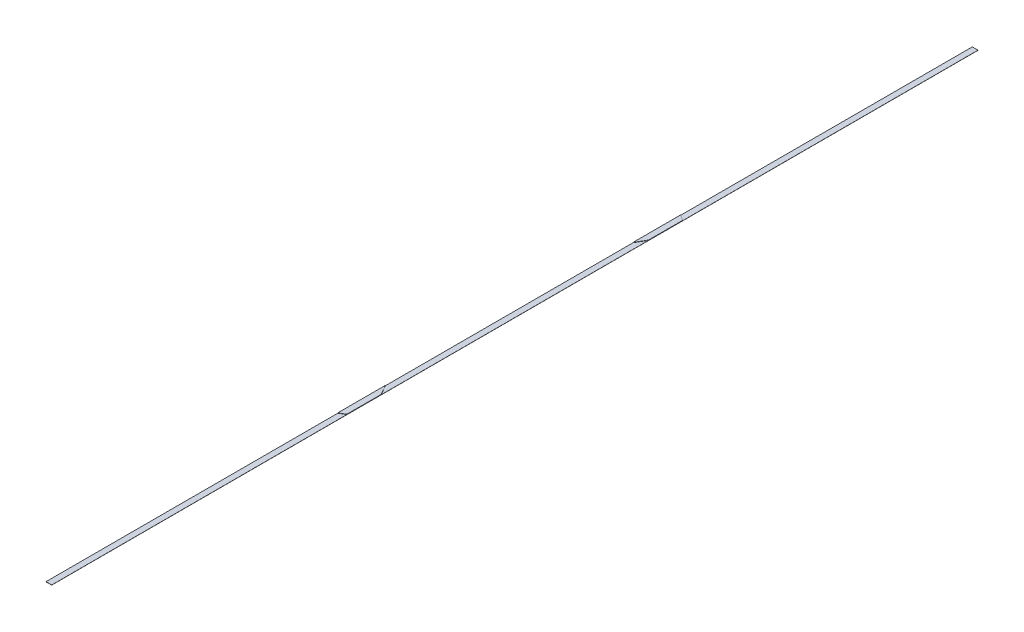
ISO-10303-21;
HEADER;
FILE_DESCRIPTION(('STEP AP214'),'2;1');
FILE_NAME('part.step','',(''),(''),'','','');
FILE_SCHEMA(('AUTOMOTIVE_DESIGN { 1 0 10303 214 1 1 1 1 }'));
ENDSEC;
DATA;
#1=APPLICATION_CONTEXT('core data for automotive mechanical design processes');
#2=APPLICATION_PROTOCOL_DEFINITION('international standard','automotive_design',2000,#1);
#3=PRODUCT_CONTEXT('',#1,'mechanical');
#4=PRODUCT('Part','Part','',(#3));
#5=PRODUCT_RELATED_PRODUCT_CATEGORY('part','',(#4));
#6=PRODUCT_DEFINITION_FORMATION('','',#4);
#7=PRODUCT_DEFINITION_CONTEXT('part definition',#1,'design');
#8=PRODUCT_DEFINITION('design','',#6,#7);
#9=PRODUCT_DEFINITION_SHAPE('','',#8);
#10=(LENGTH_UNIT() NAMED_UNIT(*) SI_UNIT(.MILLI.,.METRE.));
#11=(NAMED_UNIT(*) PLANE_ANGLE_UNIT() SI_UNIT($,.RADIAN.));
#12=(NAMED_UNIT(*) SI_UNIT($,.STERADIAN.) SOLID_ANGLE_UNIT());
#13=UNCERTAINTY_MEASURE_WITH_UNIT(LENGTH_MEASURE(1.E-05),#10,'distance_accuracy_value','');
#14=(GEOMETRIC_REPRESENTATION_CONTEXT(3) GLOBAL_UNCERTAINTY_ASSIGNED_CONTEXT((#13)) GLOBAL_UNIT_ASSIGNED_CONTEXT((#10,
#11,#12)) REPRESENTATION_CONTEXT('',''));
#15=CARTESIAN_POINT('',(0.,0.,0.));
#16=DIRECTION('',(0.,0.,1.));
#17=DIRECTION('',(1.,0.,0.));
#18=AXIS2_PLACEMENT_3D('',#15,#16,#17);
#19=CARTESIAN_POINT('',(0.,1.27,0.));
#20=DIRECTION('',(0.,1.,0.));
#21=DIRECTION('',(0.,0.,1.));
#22=AXIS2_PLACEMENT_3D('',#19,#20,#21);
#23=PLANE('',#22);
#24=DIRECTION('',(0.866025403784439,0.,0.499999999999998));
#25=VECTOR('',#24,1.);
#26=CARTESIAN_POINT('',(-25.3999999999997,1.27,-1521.16536));
#27=LINE('',#26,#25);
#28=CARTESIAN_POINT('',(-25.4000000000002,1.27,-1521.16536));
#29=VERTEX_POINT('',#28);
#30=CARTESIAN_POINT('',(25.4,1.27,-1491.83596632517));
#31=VERTEX_POINT('',#30);
#32=EDGE_CURVE('E140',#29,#31,#27,.T.);
#33=ORIENTED_EDGE('',*,*,#32,.T.);
#34=DIRECTION('',(0.,0.,-1.));
#35=VECTOR('',#34,1.);
#36=CARTESIAN_POINT('',(25.3999999999995,1.27,-4111.96536));
#37=LINE('',#36,#35);
#38=CARTESIAN_POINT('',(25.3999999999995,1.27,-4111.96536));
#39=VERTEX_POINT('',#38);
#40=EDGE_CURVE('E128',#31,#39,#37,.T.);
#41=ORIENTED_EDGE('',*,*,#40,.T.);
#42=DIRECTION('',(-1.,0.,0.));
#43=VECTOR('',#42,1.);
#44=CARTESIAN_POINT('',(-25.4000000000005,1.27,-4111.96536));
#45=LINE('',#44,#43);
#46=CARTESIAN_POINT('',(-25.4000000000005,1.27,-4111.96536));
#47=VERTEX_POINT('',#46);
#48=EDGE_CURVE('E193',#39,#47,#45,.T.);
#49=ORIENTED_EDGE('',*,*,#48,.T.);
#50=DIRECTION('',(0.,0.,1.));
#51=VECTOR('',#50,1.);
#52=CARTESIAN_POINT('',(-25.4000000000005,1.27,-4111.96536));
#53=LINE('',#52,#51);
#54=EDGE_CURVE('E61',#47,#29,#53,.T.);
#55=ORIENTED_EDGE('',*,*,#54,.T.);
#56=EDGE_LOOP('',(#33,#41,#49,#55));
#57=FACE_BOUND('',#56,.T.);
#58=ADVANCED_FACE('F38',(#57),#23,.T.);
#59=DIRECTION('',(0.86602540378444,0.,-0.499999999999998));
#60=VECTOR('',#59,1.);
#61=CARTESIAN_POINT('',(652.333922558449,1.27,1129.87549737194));
#62=LINE('',#61,#60);
#63=CARTESIAN_POINT('',(-25.3999999999995,1.27,1521.16536));
#64=VERTEX_POINT('',#63);
#65=CARTESIAN_POINT('',(25.4000000000004,1.27,1491.83596632517));
#66=VERTEX_POINT('',#65);
#67=EDGE_CURVE('E170',#64,#66,#62,.T.);
#68=ORIENTED_EDGE('',*,*,#67,.F.);
#69=CARTESIAN_POINT('',(-25.3999999999995,1.27,4111.96536));
#70=VERTEX_POINT('',#69);
#71=EDGE_CURVE('E195',#64,#70,#53,.T.);
#72=ORIENTED_EDGE('',*,*,#71,.T.);
#73=DIRECTION('',(1.,0.,0.));
#74=VECTOR('',#73,1.);
#75=CARTESIAN_POINT('',(-25.3999999999995,1.27,4111.96536));
#76=LINE('',#75,#74);
#77=CARTESIAN_POINT('',(25.4000000000005,1.27,4111.96536));
#78=VERTEX_POINT('',#77);
#79=EDGE_CURVE('E197',#70,#78,#76,.T.);
#80=ORIENTED_EDGE('',*,*,#79,.T.);
#81=EDGE_CURVE('E138',#78,#66,#37,.T.);
#82=ORIENTED_EDGE('',*,*,#81,.T.);
#83=EDGE_LOOP('',(#68,#72,#80,#82));
#84=FACE_BOUND('',#83,.T.);
#85=ADVANCED_FACE('F230',(#84),#23,.T.);
#86=CARTESIAN_POINT('',(25.3999999999995,1.27,-4111.96536));
#87=DIRECTION('',(-1.,0.,0.));
#88=DIRECTION('',(0.,0.,1.));
#89=AXIS2_PLACEMENT_3D('',#86,#87,#88);
#90=PLANE('',#89);
#91=DIRECTION('',(0.,0.,-1.));
#92=VECTOR('',#91,1.);
#93=CARTESIAN_POINT('',(25.3999999999995,0.,-4111.96536));
#94=LINE('',#93,#92);
#95=CARTESIAN_POINT('',(25.4000000000005,0.,4111.96536));
#96=VERTEX_POINT('',#95);
#97=CARTESIAN_POINT('',(25.3999999999995,0.,-4111.96536));
#98=VERTEX_POINT('',#97);
#99=EDGE_CURVE('E191',#96,#98,#94,.T.);
#100=ORIENTED_EDGE('',*,*,#99,.T.);
#101=DIRECTION('',(0.,-1.,0.));
#102=VECTOR('',#101,1.);
#103=CARTESIAN_POINT('',(25.3999999999995,1.27,-4111.96536));
#104=LINE('',#103,#102);
#105=EDGE_CURVE('E11',#39,#98,#104,.T.);
#106=ORIENTED_EDGE('',*,*,#105,.F.);
#107=ORIENTED_EDGE('',*,*,#40,.F.);
#108=DIRECTION('',(0.,-1.,0.));
#109=VECTOR('',#108,1.);
#110=CARTESIAN_POINT('',(25.4,3.92684,-1491.83596632517));
#111=LINE('',#110,#109);
#112=CARTESIAN_POINT('',(25.4,3.92684,-1491.83596632517));
#113=VERTEX_POINT('',#112);
#114=EDGE_CURVE('E132',#113,#31,#111,.T.);
#115=ORIENTED_EDGE('',*,*,#114,.F.);
#116=DIRECTION('',(0.,0.,-1.));
#117=VECTOR('',#116,1.);
#118=CARTESIAN_POINT('',(25.4,3.92684,-1187.03596632517));
#119=LINE('',#118,#117);
#120=CARTESIAN_POINT('',(25.4,3.92684,-1187.03596632517));
#121=VERTEX_POINT('',#120);
#122=EDGE_CURVE('E163',#121,#113,#119,.T.);
#123=ORIENTED_EDGE('',*,*,#122,.F.);
#124=DIRECTION('',(0.,-1.,0.));
#125=VECTOR('',#124,1.);
#126=CARTESIAN_POINT('',(25.4,3.92684,-1187.03596632517));
#127=LINE('',#126,#125);
#128=CARTESIAN_POINT('',(25.3999999999999,1.27,-1187.03596632517));
#129=VERTEX_POINT('',#128);
#130=EDGE_CURVE('E148',#121,#129,#127,.T.);
#131=ORIENTED_EDGE('',*,*,#130,.T.);
#132=CARTESIAN_POINT('',(25.4000000000006,1.27,1187.03596632517));
#133=VERTEX_POINT('',#132);
#134=EDGE_CURVE('E135',#133,#129,#37,.T.);
#135=ORIENTED_EDGE('',*,*,#134,.F.);
#136=DIRECTION('',(0.,-1.,0.));
#137=VECTOR('',#136,1.);
#138=CARTESIAN_POINT('',(25.4000000000002,3.92684,1187.03596632517));
#139=LINE('',#138,#137);
#140=CARTESIAN_POINT('',(25.4000000000002,3.92684,1187.03596632517));
#141=VERTEX_POINT('',#140);
#142=EDGE_CURVE('E189',#141,#133,#139,.T.);
#143=ORIENTED_EDGE('',*,*,#142,.F.);
#144=DIRECTION('',(0.,0.,-1.));
#145=VECTOR('',#144,1.);
#146=CARTESIAN_POINT('',(25.4,3.92684,0.));
#147=LINE('',#146,#145);
#148=CARTESIAN_POINT('',(25.4000000000003,3.92684,1491.83596632517));
#149=VERTEX_POINT('',#148);
#150=EDGE_CURVE('E166',#149,#141,#147,.T.);
#151=ORIENTED_EDGE('',*,*,#150,.F.);
#152=DIRECTION('',(0.,-1.,0.));
#153=VECTOR('',#152,1.);
#154=CARTESIAN_POINT('',(25.4000000000003,3.92684,1491.83596632517));
#155=LINE('',#154,#153);
#156=EDGE_CURVE('E176',#149,#66,#155,.T.);
#157=ORIENTED_EDGE('',*,*,#156,.T.);
#158=ORIENTED_EDGE('',*,*,#81,.F.);
#159=DIRECTION('',(0.,-1.,0.));
#160=VECTOR('',#159,1.);
#161=CARTESIAN_POINT('',(25.4000000000005,1.27,4111.96536));
#162=LINE('',#161,#160);
#163=EDGE_CURVE('E200',#78,#96,#162,.T.);
#164=ORIENTED_EDGE('',*,*,#163,.T.);
#165=EDGE_LOOP('',(#100,#106,#107,#115,#123,#131,#135,#143,#151,#157,#158,#164));
#166=FACE_BOUND('',#165,.T.);
#167=ADVANCED_FACE('F40',(#166),#90,.F.);
#168=CARTESIAN_POINT('',(-25.4000000000005,1.27,-4111.96536));
#169=DIRECTION('',(0.,0.,1.));
#170=DIRECTION('',(1.,0.,0.));
#171=AXIS2_PLACEMENT_3D('',#168,#169,#170);
#172=PLANE('',#171);
#173=DIRECTION('',(-1.,0.,0.));
#174=VECTOR('',#173,1.);
#175=CARTESIAN_POINT('',(-25.4000000000005,0.,-4111.96536));
#176=LINE('',#175,#174);
#177=CARTESIAN_POINT('',(-25.4000000000005,0.,-4111.96536));
#178=VERTEX_POINT('',#177);
#179=EDGE_CURVE('E202',#98,#178,#176,.T.);
#180=ORIENTED_EDGE('',*,*,#179,.T.);
#181=DIRECTION('',(0.,-1.,0.));
#182=VECTOR('',#181,1.);
#183=CARTESIAN_POINT('',(-25.4000000000005,1.27,-4111.96536));
#184=LINE('',#183,#182);
#185=EDGE_CURVE('E46',#47,#178,#184,.T.);
#186=ORIENTED_EDGE('',*,*,#185,.F.);
#187=ORIENTED_EDGE('',*,*,#48,.F.);
#188=ORIENTED_EDGE('',*,*,#105,.T.);
#189=EDGE_LOOP('',(#180,#186,#187,#188));
#190=FACE_BOUND('',#189,.T.);
#191=ADVANCED_FACE('F273',(#190),#172,.F.);
#192=CARTESIAN_POINT('',(-25.4000000000005,1.27,-4111.96536));
#193=DIRECTION('',(1.,0.,0.));
#194=DIRECTION('',(0.,0.,-1.));
#195=AXIS2_PLACEMENT_3D('',#192,#193,#194);
#196=PLANE('',#195);
#197=DIRECTION('',(0.,0.,1.));
#198=VECTOR('',#197,1.);
#199=CARTESIAN_POINT('',(-25.4000000000005,0.,-4111.96536));
#200=LINE('',#199,#198);
#201=CARTESIAN_POINT('',(-25.3999999999995,0.,4111.96536));
#202=VERTEX_POINT('',#201);
#203=EDGE_CURVE('E204',#178,#202,#200,.T.);
#204=ORIENTED_EDGE('',*,*,#203,.T.);
#205=DIRECTION('',(0.,-1.,0.));
#206=VECTOR('',#205,1.);
#207=CARTESIAN_POINT('',(-25.3999999999995,1.27,4111.96536));
#208=LINE('',#207,#206);
#209=EDGE_CURVE('E209',#70,#202,#208,.T.);
#210=ORIENTED_EDGE('',*,*,#209,.F.);
#211=ORIENTED_EDGE('',*,*,#71,.F.);
#212=DIRECTION('',(0.,-1.,0.));
#213=VECTOR('',#212,1.);
#214=CARTESIAN_POINT('',(-25.3999999999997,3.92684,1521.16536));
#215=LINE('',#214,#213);
#216=CARTESIAN_POINT('',(-25.3999999999997,3.92684,1521.16536));
#217=VERTEX_POINT('',#216);
#218=EDGE_CURVE('E183',#217,#64,#215,.T.);
#219=ORIENTED_EDGE('',*,*,#218,.F.);
#220=DIRECTION('',(0.,0.,1.));
#221=VECTOR('',#220,1.);
#222=CARTESIAN_POINT('',(-25.4,3.92684,0.));
#223=LINE('',#222,#221);
#224=CARTESIAN_POINT('',(-25.3999999999999,3.92684,1099.04778530067));
#225=VERTEX_POINT('',#224);
#226=EDGE_CURVE('E172',#225,#217,#223,.T.);
#227=ORIENTED_EDGE('',*,*,#226,.F.);
#228=DIRECTION('',(0.,-1.,0.));
#229=VECTOR('',#228,1.);
#230=CARTESIAN_POINT('',(-25.3999999999999,3.92684,1099.04778530067));
#231=LINE('',#230,#229);
#232=CARTESIAN_POINT('',(-25.3999999999999,1.27,1099.04778530067));
#233=VERTEX_POINT('',#232);
#234=EDGE_CURVE('E186',#225,#233,#231,.T.);
#235=ORIENTED_EDGE('',*,*,#234,.T.);
#236=CARTESIAN_POINT('',(-25.3999999999999,1.27,-1099.04778530067));
#237=VERTEX_POINT('',#236);
#238=EDGE_CURVE('E198',#237,#233,#53,.T.);
#239=ORIENTED_EDGE('',*,*,#238,.F.);
#240=DIRECTION('',(0.,-1.,0.));
#241=VECTOR('',#240,1.);
#242=CARTESIAN_POINT('',(-25.3999999999998,3.92684,-1099.04778530067));
#243=LINE('',#242,#241);
#244=CARTESIAN_POINT('',(-25.3999999999998,3.92684,-1099.04778530067));
#245=VERTEX_POINT('',#244);
#246=EDGE_CURVE('E153',#245,#237,#243,.T.);
#247=ORIENTED_EDGE('',*,*,#246,.F.);
#248=DIRECTION('',(0.,0.,1.));
#249=VECTOR('',#248,1.);
#250=CARTESIAN_POINT('',(-25.3999999999997,3.92684,-1521.16536));
#251=LINE('',#250,#249);
#252=CARTESIAN_POINT('',(-25.3999999999997,3.92684,-1521.16536));
#253=VERTEX_POINT('',#252);
#254=EDGE_CURVE('E147',#253,#245,#251,.T.);
#255=ORIENTED_EDGE('',*,*,#254,.F.);
#256=DIRECTION('',(0.,-1.,0.));
#257=VECTOR('',#256,1.);
#258=CARTESIAN_POINT('',(-25.3999999999997,3.92684,-1521.16536));
#259=LINE('',#258,#257);
#260=EDGE_CURVE('E158',#253,#29,#259,.T.);
#261=ORIENTED_EDGE('',*,*,#260,.T.);
#262=ORIENTED_EDGE('',*,*,#54,.F.);
#263=ORIENTED_EDGE('',*,*,#185,.T.);
#264=EDGE_LOOP('',(#204,#210,#211,#219,#227,#235,#239,#247,#255,#261,#262,#263));
#265=FACE_BOUND('',#264,.T.);
#266=ADVANCED_FACE('F215',(#265),#196,.F.);
#267=CARTESIAN_POINT('',(-25.3999999999995,1.27,4111.96536));
#268=DIRECTION('',(0.,0.,-1.));
#269=DIRECTION('',(-1.,0.,0.));
#270=AXIS2_PLACEMENT_3D('',#267,#268,#269);
#271=PLANE('',#270);
#272=DIRECTION('',(1.,0.,0.));
#273=VECTOR('',#272,1.);
#274=CARTESIAN_POINT('',(-25.3999999999995,0.,4111.96536));
#275=LINE('',#274,#273);
#276=EDGE_CURVE('E136',#202,#96,#275,.T.);
#277=ORIENTED_EDGE('',*,*,#276,.T.);
#278=ORIENTED_EDGE('',*,*,#163,.F.);
#279=ORIENTED_EDGE('',*,*,#79,.F.);
#280=ORIENTED_EDGE('',*,*,#209,.T.);
#281=EDGE_LOOP('',(#277,#278,#279,#280));
#282=FACE_BOUND('',#281,.T.);
#283=ADVANCED_FACE('F224',(#282),#271,.F.);
#284=DIRECTION('',(-0.500000000000003,0.,0.866025403784437));
#285=VECTOR('',#284,1.);
#286=CARTESIAN_POINT('',(25.4,1.27,-1187.03596632517));
#287=LINE('',#286,#285);
#288=EDGE_CURVE('E53',#129,#237,#287,.T.);
#289=ORIENTED_EDGE('',*,*,#288,.T.);
#290=ORIENTED_EDGE('',*,*,#238,.T.);
#291=DIRECTION('',(-0.500000000000003,0.,-0.866025403784437));
#292=VECTOR('',#291,1.);
#293=CARTESIAN_POINT('',(-494.951651021704,1.27,285.760468953233));
#294=LINE('',#293,#292);
#295=EDGE_CURVE('E142',#133,#233,#294,.T.);
#296=ORIENTED_EDGE('',*,*,#295,.F.);
#297=ORIENTED_EDGE('',*,*,#134,.T.);
#298=EDGE_LOOP('',(#289,#290,#296,#297));
#299=FACE_BOUND('',#298,.T.);
#300=ADVANCED_FACE('F237',(#299),#23,.T.);
#301=CARTESIAN_POINT('',(0.,0.,0.));
#302=DIRECTION('',(0.,1.,0.));
#303=DIRECTION('',(0.,0.,1.));
#304=AXIS2_PLACEMENT_3D('',#301,#302,#303);
#305=PLANE('',#304);
#306=ORIENTED_EDGE('',*,*,#99,.F.);
#307=ORIENTED_EDGE('',*,*,#276,.F.);
#308=ORIENTED_EDGE('',*,*,#203,.F.);
#309=ORIENTED_EDGE('',*,*,#179,.F.);
#310=EDGE_LOOP('',(#306,#307,#308,#309));
#311=FACE_BOUND('',#310,.T.);
#312=ADVANCED_FACE('F221',(#311),#305,.F.);
#313=CARTESIAN_POINT('',(-494.951651021704,3.92684,285.760468953233));
#314=DIRECTION('',(-0.866025403784437,0.,0.500000000000003));
#315=DIRECTION('',(0.500000000000003,0.,0.866025403784437));
#316=AXIS2_PLACEMENT_3D('',#313,#314,#315);
#317=PLANE('',#316);
#318=ORIENTED_EDGE('',*,*,#295,.T.);
#319=ORIENTED_EDGE('',*,*,#234,.F.);
#320=DIRECTION('',(-0.500000000000003,0.,-0.866025403784437));
#321=VECTOR('',#320,1.);
#322=CARTESIAN_POINT('',(-494.951651021704,3.92684,285.760468953233));
#323=LINE('',#322,#321);
#324=EDGE_CURVE('E169',#141,#225,#323,.T.);
#325=ORIENTED_EDGE('',*,*,#324,.F.);
#326=ORIENTED_EDGE('',*,*,#142,.T.);
#327=EDGE_LOOP('',(#318,#319,#325,#326));
#328=FACE_BOUND('',#327,.T.);
#329=ADVANCED_FACE('F242',(#328),#317,.F.);
#330=CARTESIAN_POINT('',(652.333922558449,3.92684,1129.87549737194));
#331=DIRECTION('',(-0.499999999999998,0.,-0.866025403784439));
#332=DIRECTION('',(-0.86602540378444,0.,0.499999999999998));
#333=AXIS2_PLACEMENT_3D('',#330,#331,#332);
#334=PLANE('',#333);
#335=ORIENTED_EDGE('',*,*,#67,.T.);
#336=ORIENTED_EDGE('',*,*,#156,.F.);
#337=DIRECTION('',(0.86602540378444,0.,-0.499999999999998));
#338=VECTOR('',#337,1.);
#339=CARTESIAN_POINT('',(652.333922558449,3.92684,1129.87549737194));
#340=LINE('',#339,#338);
#341=EDGE_CURVE('E174',#217,#149,#340,.T.);
#342=ORIENTED_EDGE('',*,*,#341,.F.);
#343=ORIENTED_EDGE('',*,*,#218,.T.);
#344=EDGE_LOOP('',(#335,#336,#342,#343));
#345=FACE_BOUND('',#344,.T.);
#346=ADVANCED_FACE('F233',(#345),#334,.F.);
#347=CARTESIAN_POINT('',(0.,3.92684,0.));
#348=DIRECTION('',(0.,1.,0.));
#349=DIRECTION('',(0.,0.,1.));
#350=AXIS2_PLACEMENT_3D('',#347,#348,#349);
#351=PLANE('',#350);
#352=ORIENTED_EDGE('',*,*,#150,.T.);
#353=ORIENTED_EDGE('',*,*,#324,.T.);
#354=ORIENTED_EDGE('',*,*,#226,.T.);
#355=ORIENTED_EDGE('',*,*,#341,.T.);
#356=EDGE_LOOP('',(#352,#353,#354,#355));
#357=FACE_BOUND('',#356,.T.);
#358=ADVANCED_FACE('F348',(#357),#351,.T.);
#359=CARTESIAN_POINT('',(-25.3999999999997,3.92684,-1521.16536));
#360=DIRECTION('',(0.499999999999998,0.,-0.866025403784439));
#361=DIRECTION('',(-0.86602540378444,0.,-0.499999999999998));
#362=AXIS2_PLACEMENT_3D('',#359,#360,#361);
#363=PLANE('',#362);
#364=ORIENTED_EDGE('',*,*,#32,.F.);
#365=ORIENTED_EDGE('',*,*,#260,.F.);
#366=DIRECTION('',(0.866025403784439,0.,0.499999999999998));
#367=VECTOR('',#366,1.);
#368=CARTESIAN_POINT('',(-25.3999999999997,3.92684,-1521.16536));
#369=LINE('',#368,#367);
#370=EDGE_CURVE('E146',#253,#113,#369,.T.);
#371=ORIENTED_EDGE('',*,*,#370,.T.);
#372=ORIENTED_EDGE('',*,*,#114,.T.);
#373=EDGE_LOOP('',(#364,#365,#371,#372));
#374=FACE_BOUND('',#373,.T.);
#375=ADVANCED_FACE('F144',(#374),#363,.T.);
#376=CARTESIAN_POINT('',(25.4,3.92684,-1187.03596632517));
#377=DIRECTION('',(0.866025403784437,0.,0.500000000000003));
#378=DIRECTION('',(0.500000000000003,0.,-0.866025403784437));
#379=AXIS2_PLACEMENT_3D('',#376,#377,#378);
#380=PLANE('',#379);
#381=ORIENTED_EDGE('',*,*,#288,.F.);
#382=ORIENTED_EDGE('',*,*,#130,.F.);
#383=DIRECTION('',(-0.500000000000003,0.,0.866025403784437));
#384=VECTOR('',#383,1.);
#385=CARTESIAN_POINT('',(25.4,3.92684,-1187.03596632517));
#386=LINE('',#385,#384);
#387=EDGE_CURVE('E150',#121,#245,#386,.T.);
#388=ORIENTED_EDGE('',*,*,#387,.T.);
#389=ORIENTED_EDGE('',*,*,#246,.T.);
#390=EDGE_LOOP('',(#381,#382,#388,#389));
#391=FACE_BOUND('',#390,.T.);
#392=ADVANCED_FACE('F246',(#391),#380,.T.);
#393=CARTESIAN_POINT('',(0.,3.92684,0.));
#394=DIRECTION('',(0.,-1.,0.));
#395=DIRECTION('',(0.,0.,-1.));
#396=AXIS2_PLACEMENT_3D('',#393,#394,#395);
#397=PLANE('',#396);
#398=ORIENTED_EDGE('',*,*,#370,.F.);
#399=ORIENTED_EDGE('',*,*,#254,.T.);
#400=ORIENTED_EDGE('',*,*,#387,.F.);
#401=ORIENTED_EDGE('',*,*,#122,.T.);
#402=EDGE_LOOP('',(#398,#399,#400,#401));
#403=FACE_BOUND('',#402,.T.);
#404=ADVANCED_FACE('F249',(#403),#397,.F.);
#405=CLOSED_SHELL('',(#58,#85,#167,#191,#266,#283,#300,#312,#329,#346,#358,#375,#392,#404));
#406=MANIFOLD_SOLID_BREP('B2',#405);
#407=ADVANCED_BREP_SHAPE_REPRESENTATION('',(#18,#406),#14);
#408=SHAPE_DEFINITION_REPRESENTATION(#9,#407);
ENDSEC;
END-ISO-10303-21;
